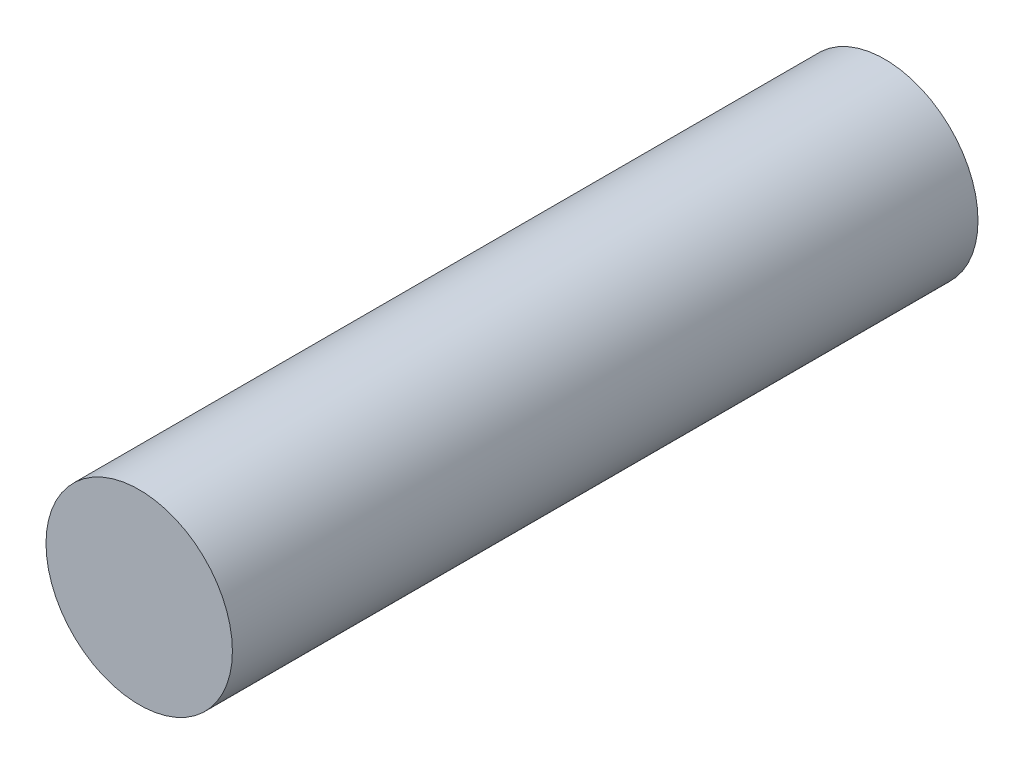
ISO-10303-21;
HEADER;
FILE_DESCRIPTION(('STEP AP214'),'2;1');
FILE_NAME('part.step','',(''),(''),'','','');
FILE_SCHEMA(('AUTOMOTIVE_DESIGN { 1 0 10303 214 1 1 1 1 }'));
ENDSEC;
DATA;
#1=APPLICATION_CONTEXT('core data for automotive mechanical design processes');
#2=APPLICATION_PROTOCOL_DEFINITION('international standard','automotive_design',2000,#1);
#3=PRODUCT_CONTEXT('',#1,'mechanical');
#4=PRODUCT('Part','Part','',(#3));
#5=PRODUCT_RELATED_PRODUCT_CATEGORY('part','',(#4));
#6=PRODUCT_DEFINITION_FORMATION('','',#4);
#7=PRODUCT_DEFINITION_CONTEXT('part definition',#1,'design');
#8=PRODUCT_DEFINITION('design','',#6,#7);
#9=PRODUCT_DEFINITION_SHAPE('','',#8);
#10=(LENGTH_UNIT() NAMED_UNIT(*) SI_UNIT(.MILLI.,.METRE.));
#11=(NAMED_UNIT(*) PLANE_ANGLE_UNIT() SI_UNIT($,.RADIAN.));
#12=(NAMED_UNIT(*) SI_UNIT($,.STERADIAN.) SOLID_ANGLE_UNIT());
#13=UNCERTAINTY_MEASURE_WITH_UNIT(LENGTH_MEASURE(1.E-05),#10,'distance_accuracy_value','');
#14=(GEOMETRIC_REPRESENTATION_CONTEXT(3) GLOBAL_UNCERTAINTY_ASSIGNED_CONTEXT((#13)) GLOBAL_UNIT_ASSIGNED_CONTEXT((#10,
#11,#12)) REPRESENTATION_CONTEXT('',''));
#15=CARTESIAN_POINT('',(0.,0.,0.));
#16=DIRECTION('',(0.,0.,1.));
#17=DIRECTION('',(1.,0.,0.));
#18=AXIS2_PLACEMENT_3D('',#15,#16,#17);
#19=CARTESIAN_POINT('',(0.,0.,8.));
#20=DIRECTION('',(0.,0.,-1.));
#21=DIRECTION('',(-1.,0.,0.));
#22=AXIS2_PLACEMENT_3D('',#19,#20,#21);
#23=CYLINDRICAL_SURFACE('',#22,1.);
#24=CARTESIAN_POINT('',(0.,0.,8.));
#25=DIRECTION('',(0.,0.,1.));
#26=DIRECTION('',(1.,0.,0.));
#27=AXIS2_PLACEMENT_3D('',#24,#25,#26);
#28=CIRCLE('',#27,1.);
#29=CARTESIAN_POINT('',(1.,0.,8.));
#30=VERTEX_POINT('',#29);
#31=EDGE_CURVE('E10',#30,#30,#28,.T.);
#32=ORIENTED_EDGE('',*,*,#31,.F.);
#33=EDGE_LOOP('',(#32));
#34=FACE_BOUND('',#33,.T.);
#35=CARTESIAN_POINT('',(0.,0.,0.));
#36=DIRECTION('',(0.,0.,1.));
#37=DIRECTION('',(1.,0.,0.));
#38=AXIS2_PLACEMENT_3D('',#35,#36,#37);
#39=CIRCLE('',#38,1.);
#40=CARTESIAN_POINT('',(1.,0.,0.));
#41=VERTEX_POINT('',#40);
#42=EDGE_CURVE('E40',#41,#41,#39,.T.);
#43=ORIENTED_EDGE('',*,*,#42,.T.);
#44=EDGE_LOOP('',(#43));
#45=FACE_BOUND('',#44,.T.);
#46=ADVANCED_FACE('F37',(#34,#45),#23,.T.);
#47=CARTESIAN_POINT('',(0.,0.,8.));
#48=DIRECTION('',(0.,0.,1.));
#49=DIRECTION('',(1.,0.,0.));
#50=AXIS2_PLACEMENT_3D('',#47,#48,#49);
#51=PLANE('',#50);
#52=ORIENTED_EDGE('',*,*,#31,.T.);
#53=EDGE_LOOP('',(#52));
#54=FACE_BOUND('',#53,.T.);
#55=ADVANCED_FACE('F54',(#54),#51,.T.);
#56=CARTESIAN_POINT('',(0.,0.,0.));
#57=DIRECTION('',(0.,0.,1.));
#58=DIRECTION('',(1.,0.,0.));
#59=AXIS2_PLACEMENT_3D('',#56,#57,#58);
#60=PLANE('',#59);
#61=ORIENTED_EDGE('',*,*,#42,.F.);
#62=EDGE_LOOP('',(#61));
#63=FACE_BOUND('',#62,.T.);
#64=ADVANCED_FACE('F52',(#63),#60,.F.);
#65=CLOSED_SHELL('',(#46,#55,#64));
#66=MANIFOLD_SOLID_BREP('B2',#65);
#67=ADVANCED_BREP_SHAPE_REPRESENTATION('',(#18,#66),#14);
#68=SHAPE_DEFINITION_REPRESENTATION(#9,#67);
ENDSEC;
END-ISO-10303-21;
